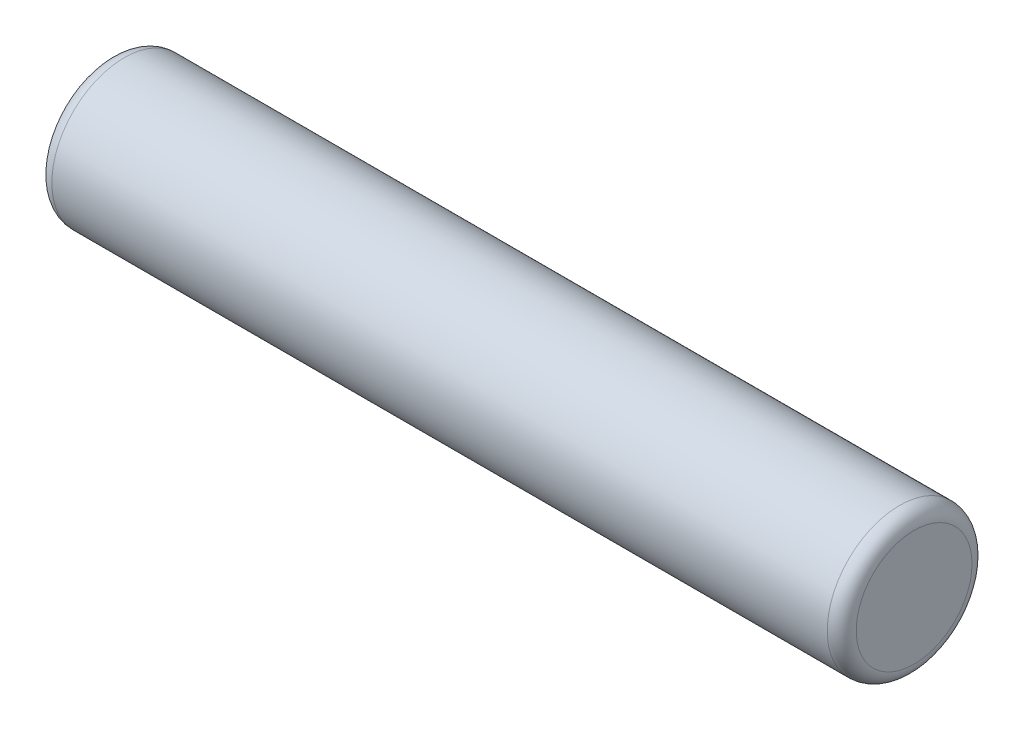
ISO-10303-21;
HEADER;
FILE_DESCRIPTION(('STEP AP214'),'2;1');
FILE_NAME('part.step','',(''),(''),'','','');
FILE_SCHEMA(('AUTOMOTIVE_DESIGN { 1 0 10303 214 1 1 1 1 }'));
ENDSEC;
DATA;
#1=APPLICATION_CONTEXT('core data for automotive mechanical design processes');
#2=APPLICATION_PROTOCOL_DEFINITION('international standard','automotive_design',2000,#1);
#3=PRODUCT_CONTEXT('',#1,'mechanical');
#4=PRODUCT('Part','Part','',(#3));
#5=PRODUCT_RELATED_PRODUCT_CATEGORY('part','',(#4));
#6=PRODUCT_DEFINITION_FORMATION('','',#4);
#7=PRODUCT_DEFINITION_CONTEXT('part definition',#1,'design');
#8=PRODUCT_DEFINITION('design','',#6,#7);
#9=PRODUCT_DEFINITION_SHAPE('','',#8);
#10=(LENGTH_UNIT() NAMED_UNIT(*) SI_UNIT(.MILLI.,.METRE.));
#11=(NAMED_UNIT(*) PLANE_ANGLE_UNIT() SI_UNIT($,.RADIAN.));
#12=(NAMED_UNIT(*) SI_UNIT($,.STERADIAN.) SOLID_ANGLE_UNIT());
#13=UNCERTAINTY_MEASURE_WITH_UNIT(LENGTH_MEASURE(1.E-05),#10,'distance_accuracy_value','');
#14=(GEOMETRIC_REPRESENTATION_CONTEXT(3) GLOBAL_UNCERTAINTY_ASSIGNED_CONTEXT((#13)) GLOBAL_UNIT_ASSIGNED_CONTEXT((#10,
#11,#12)) REPRESENTATION_CONTEXT('',''));
#15=CARTESIAN_POINT('',(0.,0.,0.));
#16=DIRECTION('',(0.,0.,1.));
#17=DIRECTION('',(1.,0.,0.));
#18=AXIS2_PLACEMENT_3D('',#15,#16,#17);
#19=CARTESIAN_POINT('',(0.,0.,0.));
#20=DIRECTION('',(1.,0.,0.));
#21=DIRECTION('',(0.,0.,-1.));
#22=AXIS2_PLACEMENT_3D('',#19,#20,#21);
#23=PLANE('',#22);
#24=CARTESIAN_POINT('',(0.,0.,0.));
#25=DIRECTION('',(1.,0.,0.));
#26=DIRECTION('',(0.,0.,-1.));
#27=AXIS2_PLACEMENT_3D('',#24,#25,#26);
#28=CIRCLE('',#27,1.44000000000008);
#29=CARTESIAN_POINT('',(0.,0.,-1.44000000000008));
#30=VERTEX_POINT('',#29);
#31=EDGE_CURVE('E30',#30,#30,#28,.T.);
#32=ORIENTED_EDGE('',*,*,#31,.F.);
#33=EDGE_LOOP('',(#32));
#34=FACE_BOUND('',#33,.T.);
#35=ADVANCED_FACE('F15',(#34),#23,.F.);
#36=CARTESIAN_POINT('',(0.359999999999922,0.,0.));
#37=DIRECTION('',(1.,0.,0.));
#38=DIRECTION('',(0.,0.,-1.));
#39=AXIS2_PLACEMENT_3D('',#36,#37,#38);
#40=TOROIDAL_SURFACE('',#39,1.44000000000008,0.359999999999922);
#41=ORIENTED_EDGE('',*,*,#31,.T.);
#42=EDGE_LOOP('',(#41));
#43=FACE_BOUND('',#42,.T.);
#44=CARTESIAN_POINT('',(0.359999999999999,0.,0.));
#45=DIRECTION('',(1.,0.,0.));
#46=DIRECTION('',(0.,0.,-1.));
#47=AXIS2_PLACEMENT_3D('',#44,#45,#46);
#48=CIRCLE('',#47,1.8);
#49=CARTESIAN_POINT('',(0.359999999999999,0.,-1.8));
#50=VERTEX_POINT('',#49);
#51=EDGE_CURVE('E26',#50,#50,#48,.T.);
#52=ORIENTED_EDGE('',*,*,#51,.F.);
#53=EDGE_LOOP('',(#52));
#54=FACE_BOUND('',#53,.T.);
#55=ADVANCED_FACE('F36',(#43,#54),#40,.T.);
#56=CARTESIAN_POINT('',(20.,0.,0.));
#57=DIRECTION('',(1.,0.,0.));
#58=DIRECTION('',(0.,0.,-1.));
#59=AXIS2_PLACEMENT_3D('',#56,#57,#58);
#60=CYLINDRICAL_SURFACE('',#59,1.8);
#61=CARTESIAN_POINT('',(19.64,0.,0.));
#62=DIRECTION('',(1.,0.,0.));
#63=DIRECTION('',(0.,0.,-1.));
#64=AXIS2_PLACEMENT_3D('',#61,#62,#63);
#65=CIRCLE('',#64,1.8);
#66=CARTESIAN_POINT('',(19.64,0.,-1.8));
#67=VERTEX_POINT('',#66);
#68=EDGE_CURVE('E22',#67,#67,#65,.T.);
#69=ORIENTED_EDGE('',*,*,#68,.F.);
#70=EDGE_LOOP('',(#69));
#71=FACE_BOUND('',#70,.T.);
#72=ORIENTED_EDGE('',*,*,#51,.T.);
#73=EDGE_LOOP('',(#72));
#74=FACE_BOUND('',#73,.T.);
#75=ADVANCED_FACE('F45',(#71,#74),#60,.T.);
#76=CARTESIAN_POINT('',(19.64,0.,0.));
#77=DIRECTION('',(1.,0.,0.));
#78=DIRECTION('',(0.,0.,-1.));
#79=AXIS2_PLACEMENT_3D('',#76,#77,#78);
#80=TOROIDAL_SURFACE('',#79,1.43999999999981,0.360000000000192);
#81=ORIENTED_EDGE('',*,*,#68,.T.);
#82=EDGE_LOOP('',(#81));
#83=FACE_BOUND('',#82,.T.);
#84=CARTESIAN_POINT('',(20.,0.,0.));
#85=DIRECTION('',(1.,0.,0.));
#86=DIRECTION('',(0.,0.,-1.));
#87=AXIS2_PLACEMENT_3D('',#84,#85,#86);
#88=CIRCLE('',#87,1.4400003723538);
#89=CARTESIAN_POINT('',(20.,0.,-1.4400003723538));
#90=VERTEX_POINT('',#89);
#91=EDGE_CURVE('E10',#90,#90,#88,.T.);
#92=ORIENTED_EDGE('',*,*,#91,.F.);
#93=EDGE_LOOP('',(#92));
#94=FACE_BOUND('',#93,.T.);
#95=ADVANCED_FACE('F49',(#83,#94),#80,.T.);
#96=CARTESIAN_POINT('',(20.,1.44,0.));
#97=DIRECTION('',(-1.,0.,0.));
#98=DIRECTION('',(0.,0.,1.));
#99=AXIS2_PLACEMENT_3D('',#96,#97,#98);
#100=PLANE('',#99);
#101=ORIENTED_EDGE('',*,*,#91,.T.);
#102=EDGE_LOOP('',(#101));
#103=FACE_BOUND('',#102,.T.);
#104=ADVANCED_FACE('F17',(#103),#100,.F.);
#105=CLOSED_SHELL('',(#35,#55,#75,#95,#104));
#106=MANIFOLD_SOLID_BREP('B1',#105);
#107=ADVANCED_BREP_SHAPE_REPRESENTATION('',(#18,#106),#14);
#108=SHAPE_DEFINITION_REPRESENTATION(#9,#107);
ENDSEC;
END-ISO-10303-21;
